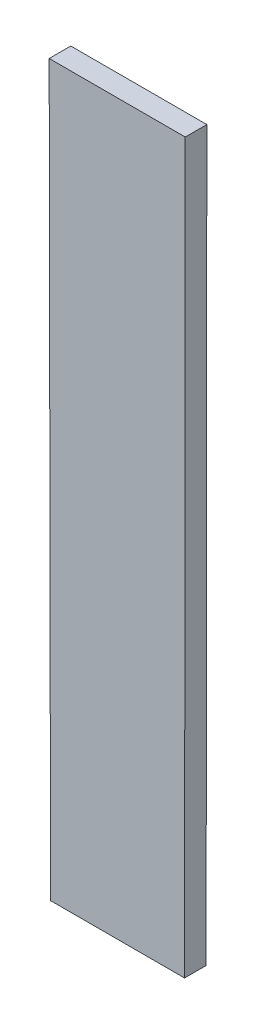
ISO-10303-21;
HEADER;
FILE_DESCRIPTION(('STEP AP214'),'2;1');
FILE_NAME('part.step','',(''),(''),'','','');
FILE_SCHEMA(('AUTOMOTIVE_DESIGN { 1 0 10303 214 1 1 1 1 }'));
ENDSEC;
DATA;
#1=APPLICATION_CONTEXT('core data for automotive mechanical design processes');
#2=APPLICATION_PROTOCOL_DEFINITION('international standard','automotive_design',2000,#1);
#3=PRODUCT_CONTEXT('',#1,'mechanical');
#4=PRODUCT('Part','Part','',(#3));
#5=PRODUCT_RELATED_PRODUCT_CATEGORY('part','',(#4));
#6=PRODUCT_DEFINITION_FORMATION('','',#4);
#7=PRODUCT_DEFINITION_CONTEXT('part definition',#1,'design');
#8=PRODUCT_DEFINITION('design','',#6,#7);
#9=PRODUCT_DEFINITION_SHAPE('','',#8);
#10=(LENGTH_UNIT() NAMED_UNIT(*) SI_UNIT(.MILLI.,.METRE.));
#11=(NAMED_UNIT(*) PLANE_ANGLE_UNIT() SI_UNIT($,.RADIAN.));
#12=(NAMED_UNIT(*) SI_UNIT($,.STERADIAN.) SOLID_ANGLE_UNIT());
#13=UNCERTAINTY_MEASURE_WITH_UNIT(LENGTH_MEASURE(1.E-05),#10,'distance_accuracy_value','');
#14=(GEOMETRIC_REPRESENTATION_CONTEXT(3) GLOBAL_UNCERTAINTY_ASSIGNED_CONTEXT((#13)) GLOBAL_UNIT_ASSIGNED_CONTEXT((#10,
#11,#12)) REPRESENTATION_CONTEXT('',''));
#15=CARTESIAN_POINT('',(0.,0.,0.));
#16=DIRECTION('',(0.,0.,1.));
#17=DIRECTION('',(1.,0.,0.));
#18=AXIS2_PLACEMENT_3D('',#15,#16,#17);
#19=CARTESIAN_POINT('',(0.,-48.6047075,0.001));
#20=DIRECTION('',(0.,-1.,0.));
#21=DIRECTION('',(0.,0.,-1.));
#22=AXIS2_PLACEMENT_3D('',#19,#20,#21);
#23=PLANE('',#22);
#24=DIRECTION('',(-1.,0.,0.));
#25=VECTOR('',#24,1.);
#26=CARTESIAN_POINT('',(0.,-48.6047075,0.));
#27=LINE('',#26,#25);
#28=CARTESIAN_POINT('',(-1.9772784375,-48.6047075,0.));
#29=VERTEX_POINT('',#28);
#30=CARTESIAN_POINT('',(-1.9835808984375,-48.6047075,0.));
#31=VERTEX_POINT('',#30);
#32=EDGE_CURVE('E11',#29,#31,#27,.T.);
#33=ORIENTED_EDGE('',*,*,#32,.T.);
#34=DIRECTION('',(0.,0.,-1.));
#35=VECTOR('',#34,1.);
#36=CARTESIAN_POINT('',(-1.9835808984375,-48.6047075,0.001));
#37=LINE('',#36,#35);
#38=CARTESIAN_POINT('',(-1.9835808984375,-48.6047075,0.001));
#39=VERTEX_POINT('',#38);
#40=EDGE_CURVE('E24',#39,#31,#37,.T.);
#41=ORIENTED_EDGE('',*,*,#40,.F.);
#42=DIRECTION('',(-1.,0.,0.));
#43=VECTOR('',#42,1.);
#44=CARTESIAN_POINT('',(0.,-48.6047075,0.001));
#45=LINE('',#44,#43);
#46=CARTESIAN_POINT('',(-1.9772784375,-48.6047075,0.001));
#47=VERTEX_POINT('',#46);
#48=EDGE_CURVE('E88',#47,#39,#45,.T.);
#49=ORIENTED_EDGE('',*,*,#48,.F.);
#50=DIRECTION('',(0.,0.,-1.));
#51=VECTOR('',#50,1.);
#52=CARTESIAN_POINT('',(-1.9772784375,-48.6047075,0.001));
#53=LINE('',#52,#51);
#54=EDGE_CURVE('E77',#47,#29,#53,.T.);
#55=ORIENTED_EDGE('',*,*,#54,.T.);
#56=EDGE_LOOP('',(#33,#41,#49,#55));
#57=FACE_BOUND('',#56,.T.);
#58=ADVANCED_FACE('F17',(#57),#23,.F.);
#59=CARTESIAN_POINT('',(-2.0757150643059,-0.00393500486127852,0.001));
#60=DIRECTION('',(0.999998203100012,0.0018957311907279,0.));
#61=DIRECTION('',(-0.0018957311907279,0.999998203100012,0.));
#62=AXIS2_PLACEMENT_3D('',#59,#60,#61);
#63=PLANE('',#62);
#64=DIRECTION('',(0.0018957311907279,-0.999998203100012,0.));
#65=VECTOR('',#64,1.);
#66=CARTESIAN_POINT('',(-2.0757150643059,-0.00393500486127852,0.));
#67=LINE('',#66,#65);
#68=CARTESIAN_POINT('',(-1.9835169140625,-48.6384592578125,0.));
#69=VERTEX_POINT('',#68);
#70=EDGE_CURVE('E85',#31,#69,#67,.T.);
#71=ORIENTED_EDGE('',*,*,#70,.T.);
#72=DIRECTION('',(0.,0.,-1.));
#73=VECTOR('',#72,1.);
#74=CARTESIAN_POINT('',(-1.9835169140625,-48.6384592578125,0.001));
#75=LINE('',#74,#73);
#76=CARTESIAN_POINT('',(-1.9835169140625,-48.6384592578125,0.001));
#77=VERTEX_POINT('',#76);
#78=EDGE_CURVE('E83',#77,#69,#75,.T.);
#79=ORIENTED_EDGE('',*,*,#78,.F.);
#80=DIRECTION('',(0.0018957311907279,-0.999998203100012,0.));
#81=VECTOR('',#80,1.);
#82=CARTESIAN_POINT('',(-2.0757150643059,-0.00393500486127852,0.001));
#83=LINE('',#82,#81);
#84=EDGE_CURVE('E72',#39,#77,#83,.T.);
#85=ORIENTED_EDGE('',*,*,#84,.F.);
#86=ORIENTED_EDGE('',*,*,#40,.T.);
#87=EDGE_LOOP('',(#71,#79,#85,#86));
#88=FACE_BOUND('',#87,.T.);
#89=ADVANCED_FACE('F90',(#88),#63,.F.);
#90=CARTESIAN_POINT('',(0.,-48.6384592578125,0.001));
#91=DIRECTION('',(0.,1.,0.));
#92=DIRECTION('',(0.,0.,1.));
#93=AXIS2_PLACEMENT_3D('',#90,#91,#92);
#94=PLANE('',#93);
#95=DIRECTION('',(1.,0.,0.));
#96=VECTOR('',#95,1.);
#97=CARTESIAN_POINT('',(0.,-48.6384592578125,0.));
#98=LINE('',#97,#96);
#99=CARTESIAN_POINT('',(-1.9773104296875,-48.6384592578125,0.));
#100=VERTEX_POINT('',#99);
#101=EDGE_CURVE('E60',#69,#100,#98,.T.);
#102=ORIENTED_EDGE('',*,*,#101,.T.);
#103=DIRECTION('',(0.,0.,-1.));
#104=VECTOR('',#103,1.);
#105=CARTESIAN_POINT('',(-1.9773104296875,-48.6384592578125,0.001));
#106=LINE('',#105,#104);
#107=CARTESIAN_POINT('',(-1.9773104296875,-48.6384592578125,0.001));
#108=VERTEX_POINT('',#107);
#109=EDGE_CURVE('E54',#108,#100,#106,.T.);
#110=ORIENTED_EDGE('',*,*,#109,.F.);
#111=DIRECTION('',(1.,0.,0.));
#112=VECTOR('',#111,1.);
#113=CARTESIAN_POINT('',(0.,-48.6384592578125,0.001));
#114=LINE('',#113,#112);
#115=EDGE_CURVE('E58',#77,#108,#114,.T.);
#116=ORIENTED_EDGE('',*,*,#115,.F.);
#117=ORIENTED_EDGE('',*,*,#78,.T.);
#118=EDGE_LOOP('',(#102,#110,#116,#117));
#119=FACE_BOUND('',#118,.T.);
#120=ADVANCED_FACE('F56',(#119),#94,.F.);
#121=CARTESIAN_POINT('',(-1.9312058896062,0.00183052690962046,0.001));
#122=DIRECTION('',(-0.999999550774095,0.000947866872792968,0.));
#123=DIRECTION('',(-0.000947866872792968,-0.999999550774095,0.));
#124=AXIS2_PLACEMENT_3D('',#121,#122,#123);
#125=PLANE('',#124);
#126=DIRECTION('',(0.000947866872792968,0.999999550774095,0.));
#127=VECTOR('',#126,1.);
#128=CARTESIAN_POINT('',(-1.9312058896062,0.00183052690962046,0.));
#129=LINE('',#128,#127);
#130=EDGE_CURVE('E73',#100,#29,#129,.T.);
#131=ORIENTED_EDGE('',*,*,#130,.T.);
#132=ORIENTED_EDGE('',*,*,#54,.F.);
#133=DIRECTION('',(0.000947866872792968,0.999999550774095,0.));
#134=VECTOR('',#133,1.);
#135=CARTESIAN_POINT('',(-1.9312058896062,0.00183052690962046,0.001));
#136=LINE('',#135,#134);
#137=EDGE_CURVE('E70',#108,#47,#136,.T.);
#138=ORIENTED_EDGE('',*,*,#137,.F.);
#139=ORIENTED_EDGE('',*,*,#109,.T.);
#140=EDGE_LOOP('',(#131,#132,#138,#139));
#141=FACE_BOUND('',#140,.T.);
#142=ADVANCED_FACE('F76',(#141),#125,.F.);
#143=CARTESIAN_POINT('',(0.,0.,0.001));
#144=DIRECTION('',(0.,0.,1.));
#145=DIRECTION('',(1.,0.,0.));
#146=AXIS2_PLACEMENT_3D('',#143,#144,#145);
#147=PLANE('',#146);
#148=ORIENTED_EDGE('',*,*,#48,.T.);
#149=ORIENTED_EDGE('',*,*,#84,.T.);
#150=ORIENTED_EDGE('',*,*,#115,.T.);
#151=ORIENTED_EDGE('',*,*,#137,.T.);
#152=EDGE_LOOP('',(#148,#149,#150,#151));
#153=FACE_BOUND('',#152,.T.);
#154=ADVANCED_FACE('F69',(#153),#147,.T.);
#155=CARTESIAN_POINT('',(0.,0.,0.));
#156=DIRECTION('',(0.,0.,1.));
#157=DIRECTION('',(1.,0.,0.));
#158=AXIS2_PLACEMENT_3D('',#155,#156,#157);
#159=PLANE('',#158);
#160=ORIENTED_EDGE('',*,*,#32,.F.);
#161=ORIENTED_EDGE('',*,*,#130,.F.);
#162=ORIENTED_EDGE('',*,*,#101,.F.);
#163=ORIENTED_EDGE('',*,*,#70,.F.);
#164=EDGE_LOOP('',(#160,#161,#162,#163));
#165=FACE_BOUND('',#164,.T.);
#166=ADVANCED_FACE('F91',(#165),#159,.F.);
#167=CLOSED_SHELL('',(#58,#89,#120,#142,#154,#166));
#168=MANIFOLD_SOLID_BREP('B1',#167);
#169=ADVANCED_BREP_SHAPE_REPRESENTATION('',(#18,#168),#14);
#170=SHAPE_DEFINITION_REPRESENTATION(#9,#169);
ENDSEC;
END-ISO-10303-21;
